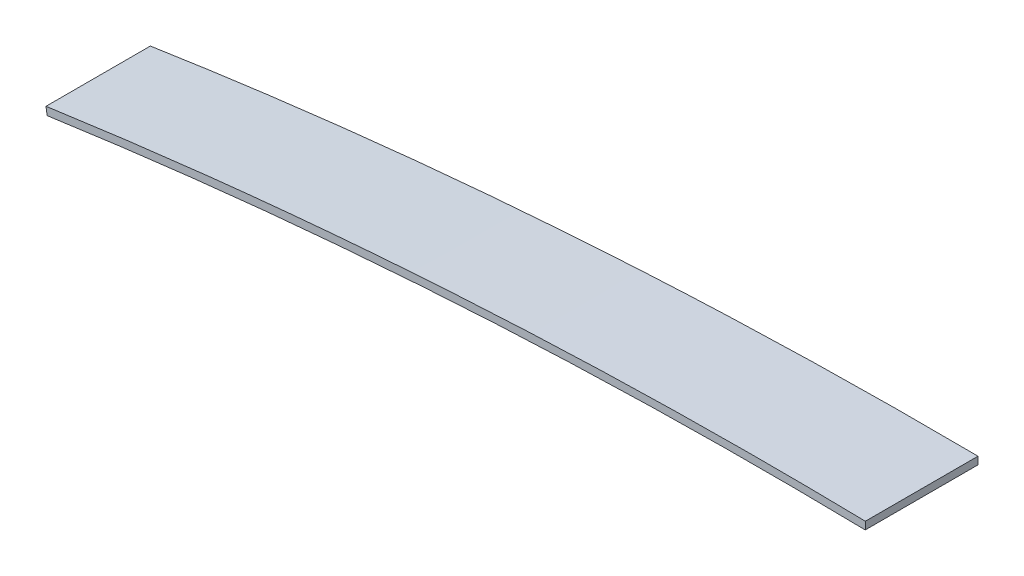
ISO-10303-21;
HEADER;
FILE_DESCRIPTION(('STEP AP214'),'2;1');
FILE_NAME('part.step','',(''),(''),'','','');
FILE_SCHEMA(('AUTOMOTIVE_DESIGN { 1 0 10303 214 1 1 1 1 }'));
ENDSEC;
DATA;
#1=APPLICATION_CONTEXT('core data for automotive mechanical design processes');
#2=APPLICATION_PROTOCOL_DEFINITION('international standard','automotive_design',2000,#1);
#3=PRODUCT_CONTEXT('',#1,'mechanical');
#4=PRODUCT('Part','Part','',(#3));
#5=PRODUCT_RELATED_PRODUCT_CATEGORY('part','',(#4));
#6=PRODUCT_DEFINITION_FORMATION('','',#4);
#7=PRODUCT_DEFINITION_CONTEXT('part definition',#1,'design');
#8=PRODUCT_DEFINITION('design','',#6,#7);
#9=PRODUCT_DEFINITION_SHAPE('','',#8);
#10=(LENGTH_UNIT() NAMED_UNIT(*) SI_UNIT(.MILLI.,.METRE.));
#11=(NAMED_UNIT(*) PLANE_ANGLE_UNIT() SI_UNIT($,.RADIAN.));
#12=(NAMED_UNIT(*) SI_UNIT($,.STERADIAN.) SOLID_ANGLE_UNIT());
#13=UNCERTAINTY_MEASURE_WITH_UNIT(LENGTH_MEASURE(1.E-05),#10,'distance_accuracy_value','');
#14=(GEOMETRIC_REPRESENTATION_CONTEXT(3) GLOBAL_UNCERTAINTY_ASSIGNED_CONTEXT((#13)) GLOBAL_UNIT_ASSIGNED_CONTEXT((#10,
#11,#12)) REPRESENTATION_CONTEXT('',''));
#15=CARTESIAN_POINT('',(0.,0.,0.));
#16=DIRECTION('',(0.,0.,1.));
#17=DIRECTION('',(1.,0.,0.));
#18=AXIS2_PLACEMENT_3D('',#15,#16,#17);
#19=CARTESIAN_POINT('',(-0.0236055975801264,-0.224658673222191,22.13));
#20=CARTESIAN_POINT('',(-0.00861740037891358,0.775228997441388,22.13));
#21=CARTESIAN_POINT('',(0.00637079682229911,1.77511666810496,22.13));
#22=CARTESIAN_POINT('',(0.0213589940235118,2.77500433876854,22.13));
#23=CARTESIAN_POINT('',(-11.732085736946,-0.0491550055107642,22.0711163055272));
#24=CARTESIAN_POINT('',(-11.7197690332317,0.950774188731922,22.0711163055272));
#25=CARTESIAN_POINT('',(-11.7074523295173,1.95070338297461,22.0711163055272));
#26=CARTESIAN_POINT('',(-11.695135625803,2.9506325772173,22.0711163055272));
#27=CARTESIAN_POINT('',(-38.7513010104425,0.118483599155071,21.9352505147691));
#28=CARTESIAN_POINT('',(-38.7479726573464,1.11856884496397,21.935250514769));
#29=CARTESIAN_POINT('',(-38.74464430425,2.11865409077287,21.935250514769));
#30=CARTESIAN_POINT('',(-38.7413159511537,3.11873933658176,21.9352505147691));
#31=CARTESIAN_POINT('',(-76.550754704927,-0.412654672267421,21.7451665476375));
#32=CARTESIAN_POINT('',(-76.5771157983934,0.58705783976191,21.7451665476375));
#33=CARTESIAN_POINT('',(-76.6034768918596,1.58677035179124,21.7451665476375));
#34=CARTESIAN_POINT('',(-76.6298379853261,2.58648286382056,21.7451665476375));
#35=CARTESIAN_POINT('',(-118.858549976443,-1.83613257253139,21.5323048244751));
#36=CARTESIAN_POINT('',(-118.898631727119,-0.836879227454239,21.532304824475));
#37=CARTESIAN_POINT('',(-118.938713477795,0.162374117622906,21.532304824475));
#38=CARTESIAN_POINT('',(-118.97879522847,1.16162746270006,21.5323048244751));
#39=CARTESIAN_POINT('',(-156.612312656246,-3.87275094167271,21.3421948681897));
#40=CARTESIAN_POINT('',(-156.678720837438,-2.87489971100038,21.3421948681896));
#41=CARTESIAN_POINT('',(-156.74512901863,-1.87704848032809,21.3421948681896));
#42=CARTESIAN_POINT('',(-156.811537199821,-0.879197249655773,21.3421948681897));
#43=CARTESIAN_POINT('',(-199.725729540157,-7.07555343976904,21.1248051429257));
#44=CARTESIAN_POINT('',(-199.806297862018,-6.07874574129601,21.1248051429257));
#45=CARTESIAN_POINT('',(-199.886866183879,-5.08193804282293,21.1248051429257));
#46=CARTESIAN_POINT('',(-199.967434505741,-4.08513034434988,21.1248051429257));
#47=CARTESIAN_POINT('',(-237.365382607952,-10.6397161535827,20.9346983586065));
#48=CARTESIAN_POINT('',(-237.472618753913,-9.64543334025073,20.9346983586065));
#49=CARTESIAN_POINT('',(-237.579854899874,-8.65115052691884,20.9346983586065));
#50=CARTESIAN_POINT('',(-237.687091045835,-7.65686771358696,20.9346983586065));
#51=CARTESIAN_POINT('',(-280.31696373724,-15.586719033481,20.7172919696932));
#52=CARTESIAN_POINT('',(-280.436280693778,-14.5937916251946,20.7172919696932));
#53=CARTESIAN_POINT('',(-280.555597650317,-13.6008642169081,20.7172919696932));
#54=CARTESIAN_POINT('',(-280.674914606858,-12.6079368086218,20.7172919696932));
#55=CARTESIAN_POINT('',(-307.079182863736,-19.2199027322983,20.5814914601982));
#56=CARTESIAN_POINT('',(-307.216376151202,-18.2293210421791,20.5814914601982));
#57=CARTESIAN_POINT('',(-307.35356943867,-17.23873935206,20.5814914601982));
#58=CARTESIAN_POINT('',(-307.490762726136,-16.2481576619406,20.5814914601982));
#59=CARTESIAN_POINT('',(-323.10984765869,-21.5949309594104,20.5));
#60=CARTESIAN_POINT('',(-323.256402582519,-20.6057284248899,20.5));
#61=CARTESIAN_POINT('',(-323.402957506348,-19.6165258903694,20.5));
#62=CARTESIAN_POINT('',(-323.549512430178,-18.6273233558489,20.5));
#63=B_SPLINE_SURFACE_WITH_KNOTS('',3,3,((#19,#20,#21,#22),(#23,#24,#25,#26),(#27,#28,#29,#30),
(#31,#32,#33,#34),(#35,#36,#37,#38),(#39,#40,#41,#42),(#43,#44,#45,#46),(#47,#48,#49,#50),(#51,
#52,#53,#54),(#55,#56,#57,#58),(#59,#60,#61,#62)),.UNSPECIFIED.,.F.,.F.,.F.,(4,1,1,1,1,1,1,1,4),
(4,4),(0.,0.108330933604828,0.249997790440512,0.349996824544666,0.499997687843605,
0.599996721947759,0.749997585246698,0.849996619350852,1.),(0.,1.),.UNSPECIFIED.);
#64=CARTESIAN_POINT('',(-323.10984765869,-21.5949309594104,20.5));
#65=CARTESIAN_POINT('',(-307.079182863736,-19.2199027322983,20.5814914601982));
#66=CARTESIAN_POINT('',(-280.31696373724,-15.586719033481,20.7172919696932));
#67=CARTESIAN_POINT('',(-237.365382607952,-10.6397161535827,20.9346983586065));
#68=CARTESIAN_POINT('',(-199.725729540157,-7.07555343976904,21.1248051429257));
#69=CARTESIAN_POINT('',(-156.612312656246,-3.87275094167271,21.3421948681897));
#70=CARTESIAN_POINT('',(-118.858549976443,-1.83613257253139,21.5323048244751));
#71=CARTESIAN_POINT('',(-76.550754704927,-0.412654672267421,21.7451665476375));
#72=CARTESIAN_POINT('',(-38.7513010104425,0.118483599155071,21.9352505147691));
#73=CARTESIAN_POINT('',(-11.732085736946,-0.0491550055107642,22.0711163055272));
#74=CARTESIAN_POINT('',(-0.0236055975801264,-0.224658673222191,22.13));
#75=B_SPLINE_CURVE_WITH_KNOTS('',3,(#64,#65,#66,#67,#68,#69,#70,#71,#72,#73,#74),.UNSPECIFIED.,
.F.,.F.,(4,1,1,1,1,1,1,1,4),(0.,0.150003380649148,0.250002414753302,0.400003278052241,
0.500002312156395,0.650003175455334,0.750002209559488,0.891669066395172,1.),.UNSPECIFIED.);
#76=CARTESIAN_POINT('',(-323.109847658689,-21.5949309594104,20.5));
#77=VERTEX_POINT('',#76);
#78=CARTESIAN_POINT('',(-0.0236055975801263,-0.224658673222189,22.13));
#79=VERTEX_POINT('',#78);
#80=EDGE_CURVE('E13',#77,#79,#75,.T.);
#81=DIRECTION('',(-0.0149881972012099,-0.999887670663389,0.));
#82=VECTOR('',#81,1.);
#83=CARTESIAN_POINT('',(-0.00112330177830725,1.27517283277317,22.13));
#84=LINE('',#83,#82);
#85=CARTESIAN_POINT('',(0.0213589940235118,2.77500433876854,22.13));
#86=VERTEX_POINT('',#85);
#87=EDGE_CURVE('E176',#86,#79,#84,.T.);
#88=CARTESIAN_POINT('',(-323.549512430178,-18.6273233558489,20.5));
#89=CARTESIAN_POINT('',(-310.169193599027,-16.6449817486356,20.5679166326291));
#90=CARTESIAN_POINT('',(-296.768758815592,-14.7984715984766,20.6358333122651));
#91=CARTESIAN_POINT('',(-269.93321273743,-11.3774837399603,20.7716666715371));
#92=CARTESIAN_POINT('',(-256.498101450976,-9.80300596672498,20.8395833511731));
#93=CARTESIAN_POINT('',(-229.598742324252,-6.92645047624379,20.9754166945177));
#94=CARTESIAN_POINT('',(-216.134494464387,-5.62437294225568,21.0433333582262));
#95=CARTESIAN_POINT('',(-189.182396746335,-3.29298481183353,21.1791666811253));
#96=CARTESIAN_POINT('',(-175.694546874478,-2.26367437344387,21.247083340316));
#97=CARTESIAN_POINT('',(-148.700780995575,-0.478187903606298,21.3829166587581));
#98=CARTESIAN_POINT('',(-135.194864988775,0.277988131564689,21.4508333180096));
#99=CARTESIAN_POINT('',(-108.170502710786,1.51683830157019,21.5866666411386));
#100=CARTESIAN_POINT('',(-94.6520564471383,1.99951260091471,21.6545833050161));
#101=CARTESIAN_POINT('',(-67.6081681621311,2.6909916689289,21.7904166488474));
#102=CARTESIAN_POINT('',(-54.0827261455301,2.89979662364007,21.8583333288011));
#103=CARTESIAN_POINT('',(-27.0303863552541,3.04316994934998,21.9941666887087));
#104=CARTESIAN_POINT('',(-13.5034885812047,2.97773824964653,22.0620833686624));
#105=CARTESIAN_POINT('',(0.0213589940237807,2.77500433876853,22.13));
#106=B_SPLINE_CURVE_WITH_KNOTS('',3,(#88,#89,#90,#91,#92,#93,#94,#95,#96,#97,#98,#99,#100,#101,
#102,#103,#104,#105),.UNSPECIFIED.,.F.,.F.,(4,2,2,2,2,2,2,2,4),(0.,40.5789051197945,
81.1578005617725,121.736723303188,162.315669556445,202.894615256574,243.473536548632,
284.052430275113,324.63133446342),.UNSPECIFIED.);
#107=CARTESIAN_POINT('',(-323.549512430178,-18.6273233558489,20.5));
#108=VERTEX_POINT('',#107);
#109=EDGE_CURVE('E219',#108,#86,#106,.T.);
#110=DIRECTION('',(0.146554923829321,-0.989202534520298,0.));
#111=VECTOR('',#110,1.);
#112=CARTESIAN_POINT('',(-323.329680044434,-20.1111271576296,20.5));
#113=LINE('',#112,#111);
#114=EDGE_CURVE('E169',#108,#77,#113,.T.);
#115=ORIENTED_EDGE('',*,*,#80,.T.);
#116=ORIENTED_EDGE('',*,*,#87,.F.);
#117=ORIENTED_EDGE('',*,*,#109,.F.);
#118=ORIENTED_EDGE('',*,*,#114,.T.);
#119=EDGE_LOOP('',(#115,#116,#117,#118));
#120=FACE_BOUND('',#119,.T.);
#121=ADVANCED_FACE('F158',(#120),#63,.F.);
#122=CARTESIAN_POINT('',(-0.0236055975801263,-0.224658673222189,-22.13));
#123=DIRECTION('',(-0.999887670663389,0.0149881972012099,0.));
#124=DIRECTION('',(0.,0.,1.));
#125=AXIS2_PLACEMENT_3D('',#122,#123,#124);
#126=PLANE('',#125);
#127=DIRECTION('',(0.,0.,-1.));
#128=VECTOR('',#127,1.);
#129=CARTESIAN_POINT('',(-0.0236055975801263,-0.224658673222188,2.95336671785051E-13));
#130=LINE('',#129,#128);
#131=CARTESIAN_POINT('',(-0.0236055975801263,-0.224658673222189,-22.13));
#132=VERTEX_POINT('',#131);
#133=EDGE_CURVE('E212',#79,#132,#130,.T.);
#134=ORIENTED_EDGE('',*,*,#133,.T.);
#135=DIRECTION('',(-0.0149881972012099,-0.999887670663389,0.));
#136=VECTOR('',#135,1.);
#137=CARTESIAN_POINT('',(-0.00112330177830725,1.27517283277317,-22.13));
#138=LINE('',#137,#136);
#139=CARTESIAN_POINT('',(0.0213589940235118,2.77500433876854,-22.13));
#140=VERTEX_POINT('',#139);
#141=EDGE_CURVE('E200',#140,#132,#138,.T.);
#142=ORIENTED_EDGE('',*,*,#141,.F.);
#143=DIRECTION('',(0.,0.,-1.));
#144=VECTOR('',#143,1.);
#145=CARTESIAN_POINT('',(0.0213589940235119,2.77500433876854,2.75821032680312E-13));
#146=LINE('',#145,#144);
#147=EDGE_CURVE('E182',#86,#140,#146,.T.);
#148=ORIENTED_EDGE('',*,*,#147,.F.);
#149=ORIENTED_EDGE('',*,*,#87,.T.);
#150=EDGE_LOOP('',(#134,#142,#148,#149));
#151=FACE_BOUND('',#150,.T.);
#152=ADVANCED_FACE('F211',(#151),#126,.F.);
#153=CARTESIAN_POINT('',(-323.10984765869,-21.5949309594104,-20.5));
#154=CARTESIAN_POINT('',(-323.256402582519,-20.6057284248899,-20.5));
#155=CARTESIAN_POINT('',(-323.402957506348,-19.6165258903694,-20.5));
#156=CARTESIAN_POINT('',(-323.549512430178,-18.6273233558489,-20.5));
#157=CARTESIAN_POINT('',(-307.079182863743,-19.2199027322989,-20.5814914601982));
#158=CARTESIAN_POINT('',(-307.216376151204,-18.2293210421796,-20.5814914601982));
#159=CARTESIAN_POINT('',(-307.353569438669,-17.2387393520603,-20.5814914601982));
#160=CARTESIAN_POINT('',(-307.490762726129,-16.2481576619409,-20.5814914601982));
#161=CARTESIAN_POINT('',(-280.316963727379,-15.5867190332293,-20.7172919697428));
#162=CARTESIAN_POINT('',(-280.436280690496,-14.5937916251059,-20.7172919697428));
#163=CARTESIAN_POINT('',(-280.555597653612,-13.6008642169826,-20.7172919697428));
#164=CARTESIAN_POINT('',(-280.674914616728,-12.6079368088591,-20.7172919697428));
#165=CARTESIAN_POINT('',(-237.365382636773,-10.6397161543186,-20.9346983584615));
#166=CARTESIAN_POINT('',(-237.472618763511,-9.64543334051019,-20.9346983584615));
#167=CARTESIAN_POINT('',(-237.57985489025,-8.65115052670192,-20.9346983584615));
#168=CARTESIAN_POINT('',(-237.687091016988,-7.65686771289366,-20.9346983584615));
#169=CARTESIAN_POINT('',(-194.348678741847,-6.5663908794958,-21.1519630404739));
#170=CARTESIAN_POINT('',(-194.425432747295,-5.56922237022664,-21.1519630404739));
#171=CARTESIAN_POINT('',(-194.502186752742,-4.57205386095747,-21.1519630404739));
#172=CARTESIAN_POINT('',(-194.57894075819,-3.5748853516883,-21.1519630404739));
#173=CARTESIAN_POINT('',(-145.8412859635,-3.16024259256723,-21.3964691184482));
#174=CARTESIAN_POINT('',(-145.894381356251,-2.16156402365039,-21.3964691184482));
#175=CARTESIAN_POINT('',(-145.947476749002,-1.16288545473354,-21.3964691184482));
#176=CARTESIAN_POINT('',(-146.000572141753,-0.164206885816677,-21.3964691184482));
#177=CARTESIAN_POINT('',(-97.2544085435141,-0.933948300312693,-21.6410306262534));
#178=CARTESIAN_POINT('',(-97.291330520634,0.065456393405649,-21.6410306262534));
#179=CARTESIAN_POINT('',(-97.3282524977539,1.06486108712399,-21.6410306262535));
#180=CARTESIAN_POINT('',(-97.3651744748737,2.06426578084233,-21.6410306262534));
#181=CARTESIAN_POINT('',(-56.7435693481674,-0.0639065090111094,-21.8447747200493));
#182=CARTESIAN_POINT('',(-56.7593747746169,0.936047173184133,-21.8447747200493));
#183=CARTESIAN_POINT('',(-56.7751802010664,1.93600085537937,-21.8447747200493));
#184=CARTESIAN_POINT('',(-56.7909856275158,2.93595453757462,-21.8447747200493));
#185=CARTESIAN_POINT('',(-24.3275564693926,0.0412061325928112,-22.0077792237709));
#186=CARTESIAN_POINT('',(-24.328110774656,1.04123834976606,-22.0077792237709));
#187=CARTESIAN_POINT('',(-24.3286650799195,2.0412705669393,-22.0077792237709));
#188=CARTESIAN_POINT('',(-24.3292193851827,3.04130278411256,-22.0077792237709));
#189=CARTESIAN_POINT('',(-8.12934621401733,-0.10315815740677,-22.0892350204062));
#190=CARTESIAN_POINT('',(-8.11620631366323,0.896758288845287,-22.0892350204062));
#191=CARTESIAN_POINT('',(-8.10306641330911,1.89667473509734,-22.0892350204062));
#192=CARTESIAN_POINT('',(-8.08992651295499,2.89659118134941,-22.0892350204062));
#193=CARTESIAN_POINT('',(-0.0236055975800431,-0.224658673222192,-22.13));
#194=CARTESIAN_POINT('',(-0.00861740037883039,0.775228997441382,-22.13));
#195=CARTESIAN_POINT('',(0.00637079682238235,1.77511666810496,-22.13));
#196=CARTESIAN_POINT('',(0.0213589940235951,2.77500433876853,-22.13));
#197=B_SPLINE_SURFACE_WITH_KNOTS('',3,3,((#153,#154,#155,#156),(#157,#158,#159,#160),(#161,#162,
#163,#164),(#165,#166,#167,#168),(#169,#170,#171,#172),(#173,#174,#175,#176),(#177,#178,#179,
#180),(#181,#182,#183,#184),(#185,#186,#187,#188),(#189,#190,#191,#192),(#193,#194,#195,#196)),
.UNSPECIFIED.,.F.,.F.,.F.,(4,1,1,1,1,1,1,1,4),(4,4),(0.,0.150003380655467,0.250002414763834,
0.400003278069093,0.550001829235492,0.700005004669729,0.85000355580284,0.925002882669548,1.),
(0.,1.),.UNSPECIFIED.);
#198=CARTESIAN_POINT('',(-0.0236055975800431,-0.224658673222192,-22.13));
#199=CARTESIAN_POINT('',(-8.12934621401733,-0.10315815740677,-22.0892350204062));
#200=CARTESIAN_POINT('',(-24.3275564693926,0.0412061325928112,-22.0077792237709));
#201=CARTESIAN_POINT('',(-56.7435693481674,-0.0639065090111094,-21.8447747200493));
#202=CARTESIAN_POINT('',(-97.2544085435141,-0.933948300312693,-21.6410306262534));
#203=CARTESIAN_POINT('',(-145.8412859635,-3.16024259256723,-21.3964691184482));
#204=CARTESIAN_POINT('',(-194.348678741847,-6.5663908794958,-21.1519630404739));
#205=CARTESIAN_POINT('',(-237.365382636773,-10.6397161543186,-20.9346983584615));
#206=CARTESIAN_POINT('',(-280.316963727379,-15.5867190332293,-20.7172919697428));
#207=CARTESIAN_POINT('',(-307.079182863743,-19.2199027322989,-20.5814914601982));
#208=CARTESIAN_POINT('',(-323.10984765869,-21.5949309594104,-20.5));
#209=B_SPLINE_CURVE_WITH_KNOTS('',3,(#198,#199,#200,#201,#202,#203,#204,#205,#206,#207,#208),
.UNSPECIFIED.,.F.,.F.,(4,1,1,1,1,1,1,1,4),(0.,0.0749971173304518,0.14999644419716,
0.299994995330271,0.449998170764508,0.599996721930907,0.749997585236166,0.849996619344533,1.),.UNSPECIFIED.);
#210=CARTESIAN_POINT('',(-323.109847658689,-21.5949309594104,-20.5));
#211=VERTEX_POINT('',#210);
#212=EDGE_CURVE('E213',#132,#211,#209,.T.);
#213=DIRECTION('',(0.146554923829321,-0.989202534520298,0.));
#214=VECTOR('',#213,1.);
#215=CARTESIAN_POINT('',(-323.329680044434,-20.1111271576296,-20.5));
#216=LINE('',#215,#214);
#217=CARTESIAN_POINT('',(-323.549512430178,-18.6273233558489,-20.5));
#218=VERTEX_POINT('',#217);
#219=EDGE_CURVE('E206',#218,#211,#216,.T.);
#220=CARTESIAN_POINT('',(0.0213589940237859,2.77500433876853,-22.13));
#221=CARTESIAN_POINT('',(-13.5034885812047,2.97773824964653,-22.0620833686624));
#222=CARTESIAN_POINT('',(-27.0303863552542,3.04316994934998,-21.9941666887086));
#223=CARTESIAN_POINT('',(-54.0827261455302,2.89979662364007,-21.8583333288011));
#224=CARTESIAN_POINT('',(-67.6081681621311,2.6909916689289,-21.7904166488473));
#225=CARTESIAN_POINT('',(-94.6520564471382,1.9995126009147,-21.654583305016));
#226=CARTESIAN_POINT('',(-108.170502710786,1.51683830157018,-21.5866666411385));
#227=CARTESIAN_POINT('',(-135.194864988775,0.277988131564679,-21.4508333180095));
#228=CARTESIAN_POINT('',(-148.700780995575,-0.478187903606307,-21.3829166587581));
#229=CARTESIAN_POINT('',(-175.694546874478,-2.26367437344388,-21.2470833403159));
#230=CARTESIAN_POINT('',(-189.182396746335,-3.29298481183354,-21.1791666811253));
#231=CARTESIAN_POINT('',(-216.134494464386,-5.6243729422557,-21.0433333582261));
#232=CARTESIAN_POINT('',(-229.598742324251,-6.92645047624381,-20.9754166945177));
#233=CARTESIAN_POINT('',(-256.498101450975,-9.80300596672499,-20.8395833511732));
#234=CARTESIAN_POINT('',(-269.93321273743,-11.3774837399603,-20.7716666715372));
#235=CARTESIAN_POINT('',(-296.768758815591,-14.7984715984766,-20.6358333122651));
#236=CARTESIAN_POINT('',(-310.169193599027,-16.6449817486356,-20.5679166326291));
#237=CARTESIAN_POINT('',(-323.549512430178,-18.6273233558489,-20.5));
#238=B_SPLINE_CURVE_WITH_KNOTS('',3,(#220,#221,#222,#223,#224,#225,#226,#227,#228,#229,#230,
#231,#232,#233,#234,#235,#236,#237),.UNSPECIFIED.,.F.,.F.,(4,2,2,2,2,2,2,2,4),(0.,
40.5789041883069,81.1577979147871,121.736719206846,162.315664906974,202.89461116023,
243.473533901646,284.052429343624,324.63133446342),.UNSPECIFIED.);
#239=EDGE_CURVE('E204',#140,#218,#238,.T.);
#240=ORIENTED_EDGE('',*,*,#212,.T.);
#241=ORIENTED_EDGE('',*,*,#219,.F.);
#242=ORIENTED_EDGE('',*,*,#239,.F.);
#243=ORIENTED_EDGE('',*,*,#141,.T.);
#244=EDGE_LOOP('',(#240,#241,#242,#243));
#245=FACE_BOUND('',#244,.T.);
#246=ADVANCED_FACE('F205',(#245),#197,.F.);
#247=CARTESIAN_POINT('',(-323.109847658689,-21.5949309594104,20.5));
#248=DIRECTION('',(0.989202534520295,0.14655492382934,0.));
#249=DIRECTION('',(0.,0.,-1.));
#250=AXIS2_PLACEMENT_3D('',#247,#248,#249);
#251=PLANE('',#250);
#252=DIRECTION('',(-2.07151369228841E-13,0.,1.));
#253=VECTOR('',#252,1.);
#254=CARTESIAN_POINT('',(-323.10984765869,-21.5949309594104,0.));
#255=LINE('',#254,#253);
#256=EDGE_CURVE('E214',#211,#77,#255,.T.);
#257=ORIENTED_EDGE('',*,*,#256,.T.);
#258=ORIENTED_EDGE('',*,*,#114,.F.);
#259=DIRECTION('',(0.,0.,1.));
#260=VECTOR('',#259,1.);
#261=CARTESIAN_POINT('',(-323.549512430177,-18.6273233558489,0.));
#262=LINE('',#261,#260);
#263=EDGE_CURVE('E209',#218,#108,#262,.T.);
#264=ORIENTED_EDGE('',*,*,#263,.F.);
#265=ORIENTED_EDGE('',*,*,#219,.T.);
#266=EDGE_LOOP('',(#257,#258,#264,#265));
#267=FACE_BOUND('',#266,.T.);
#268=ADVANCED_FACE('F160',(#267),#251,.F.);
#269=CARTESIAN_POINT('',(-323.549512430178,-18.6273233558489,22.39556));
#270=CARTESIAN_POINT('',(-216.506907878133,-2.76858448565187,22.3955599999999));
#271=CARTESIAN_POINT('',(-108.177477891251,4.3968744715036,22.3955599999999));
#272=CARTESIAN_POINT('',(0.0213589940237807,2.77500433876853,22.39556));
#273=CARTESIAN_POINT('',(-323.549512430177,-18.6273233558489,7.46518666666661));
#274=CARTESIAN_POINT('',(-216.506907878177,-2.76858448565096,7.46518666666721));
#275=CARTESIAN_POINT('',(-108.177477891251,4.39687447150366,7.46518666666607));
#276=CARTESIAN_POINT('',(0.0213589940237824,2.77500433876853,7.46518666666667));
#277=CARTESIAN_POINT('',(-323.549512430177,-18.6273233558489,-7.46518666666712));
#278=CARTESIAN_POINT('',(-216.506907878149,-2.76858448565106,-7.46518666666821));
#279=CARTESIAN_POINT('',(-108.177477891251,4.39687447150332,-7.46518666666825));
#280=CARTESIAN_POINT('',(0.0213589940237841,2.77500433876853,-7.46518666666709));
#281=CARTESIAN_POINT('',(-323.549512430178,-18.6273233558489,-22.39556));
#282=CARTESIAN_POINT('',(-216.506907878133,-2.76858448565187,-22.3955599999999));
#283=CARTESIAN_POINT('',(-108.177477891251,4.3968744715036,-22.3955599999996));
#284=CARTESIAN_POINT('',(0.0213589940237859,2.77500433876853,-22.39556));
#285=B_SPLINE_SURFACE_WITH_KNOTS('',3,3,((#269,#270,#271,#272),(#273,#274,#275,#276),(#277,#278,
#279,#280),(#281,#282,#283,#284)),.UNSPECIFIED.,.F.,.F.,.F.,(4,4),(4,4),(0.,1.),(0.,1.),.UNSPECIFIED.);
#286=ORIENTED_EDGE('',*,*,#109,.T.);
#287=ORIENTED_EDGE('',*,*,#147,.T.);
#288=ORIENTED_EDGE('',*,*,#239,.T.);
#289=ORIENTED_EDGE('',*,*,#263,.T.);
#290=EDGE_LOOP('',(#286,#287,#288,#289));
#291=FACE_BOUND('',#290,.T.);
#292=ADVANCED_FACE('F217',(#291),#285,.F.);
#293=CARTESIAN_POINT('',(-323.109847658689,-21.5949309594104,22.39556));
#294=CARTESIAN_POINT('',(-216.227583434324,-5.75982977778659,22.3955599999996));
#295=CARTESIAN_POINT('',(-108.060387245758,1.39479995896052,22.39556));
#296=CARTESIAN_POINT('',(-0.0236055975798575,-0.224658673222193,22.39556));
#297=CARTESIAN_POINT('',(-323.109847658689,-21.5949309594103,7.4651866666666));
#298=CARTESIAN_POINT('',(-216.227583434282,-5.75982977778289,7.46518666666909));
#299=CARTESIAN_POINT('',(-108.060387245757,1.39479995896054,7.46518666666611));
#300=CARTESIAN_POINT('',(-0.0236055975798557,-0.224658673222193,7.46518666666666));
#301=CARTESIAN_POINT('',(-323.109847658689,-21.5949309594103,-7.46518666666713));
#302=CARTESIAN_POINT('',(-216.227583434313,-5.75982977778721,-7.46518666666787));
#303=CARTESIAN_POINT('',(-108.060387245759,1.39479995896054,-7.46518666666859));
#304=CARTESIAN_POINT('',(-0.023605597579854,-0.224658673222193,-7.46518666666709));
#305=CARTESIAN_POINT('',(-323.109847658689,-21.5949309594104,-22.39556));
#306=CARTESIAN_POINT('',(-216.227583434324,-5.75982977778659,-22.3955599999998));
#307=CARTESIAN_POINT('',(-108.060387245758,1.39479995896053,-22.3955599999997));
#308=CARTESIAN_POINT('',(-0.0236055975798522,-0.224658673222193,-22.39556));
#309=B_SPLINE_SURFACE_WITH_KNOTS('',3,3,((#293,#294,#295,#296),(#297,#298,#299,#300),(#301,#302,
#303,#304),(#305,#306,#307,#308)),.UNSPECIFIED.,.F.,.F.,.F.,(4,4),(4,4),(0.,1.),(0.,1.),.UNSPECIFIED.);
#310=ORIENTED_EDGE('',*,*,#80,.F.);
#311=ORIENTED_EDGE('',*,*,#256,.F.);
#312=ORIENTED_EDGE('',*,*,#212,.F.);
#313=ORIENTED_EDGE('',*,*,#133,.F.);
#314=EDGE_LOOP('',(#310,#311,#312,#313));
#315=FACE_BOUND('',#314,.T.);
#316=ADVANCED_FACE('F240',(#315),#309,.T.);
#317=CLOSED_SHELL('',(#121,#152,#246,#268,#292,#316));
#318=MANIFOLD_SOLID_BREP('B2',#317);
#319=ADVANCED_BREP_SHAPE_REPRESENTATION('',(#18,#318),#14);
#320=SHAPE_DEFINITION_REPRESENTATION(#9,#319);
ENDSEC;
END-ISO-10303-21;
